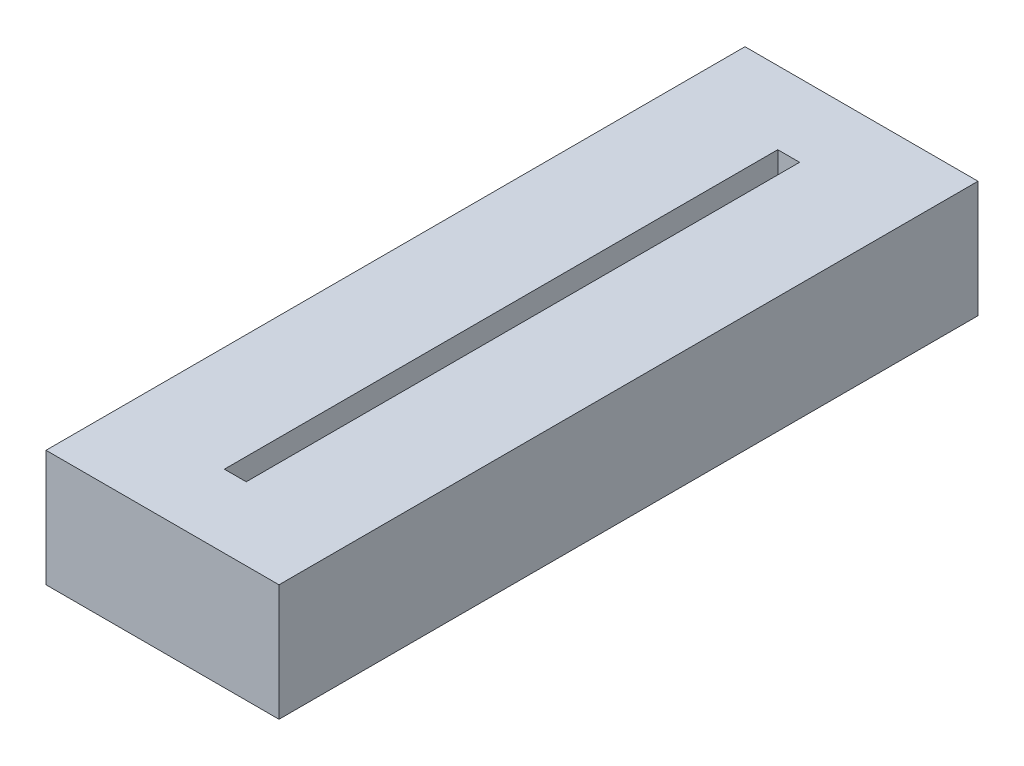
ISO-10303-21;
HEADER;
FILE_DESCRIPTION(('STEP AP214'),'2;1');
FILE_NAME('part.step','',(''),(''),'','','');
FILE_SCHEMA(('AUTOMOTIVE_DESIGN { 1 0 10303 214 1 1 1 1 }'));
ENDSEC;
DATA;
#1=APPLICATION_CONTEXT('core data for automotive mechanical design processes');
#2=APPLICATION_PROTOCOL_DEFINITION('international standard','automotive_design',2000,#1);
#3=PRODUCT_CONTEXT('',#1,'mechanical');
#4=PRODUCT('Part','Part','',(#3));
#5=PRODUCT_RELATED_PRODUCT_CATEGORY('part','',(#4));
#6=PRODUCT_DEFINITION_FORMATION('','',#4);
#7=PRODUCT_DEFINITION_CONTEXT('part definition',#1,'design');
#8=PRODUCT_DEFINITION('design','',#6,#7);
#9=PRODUCT_DEFINITION_SHAPE('','',#8);
#10=(LENGTH_UNIT() NAMED_UNIT(*) SI_UNIT(.MILLI.,.METRE.));
#11=(NAMED_UNIT(*) PLANE_ANGLE_UNIT() SI_UNIT($,.RADIAN.));
#12=(NAMED_UNIT(*) SI_UNIT($,.STERADIAN.) SOLID_ANGLE_UNIT());
#13=UNCERTAINTY_MEASURE_WITH_UNIT(LENGTH_MEASURE(1.E-05),#10,'distance_accuracy_value','');
#14=(GEOMETRIC_REPRESENTATION_CONTEXT(3) GLOBAL_UNCERTAINTY_ASSIGNED_CONTEXT((#13)) GLOBAL_UNIT_ASSIGNED_CONTEXT((#10,
#11,#12)) REPRESENTATION_CONTEXT('',''));
#15=CARTESIAN_POINT('',(0.,0.,0.));
#16=DIRECTION('',(0.,0.,1.));
#17=DIRECTION('',(1.,0.,0.));
#18=AXIS2_PLACEMENT_3D('',#15,#16,#17);
#19=CARTESIAN_POINT('',(0.,50.8,304.8));
#20=DIRECTION('',(1.,0.,0.));
#21=DIRECTION('',(0.,0.,-1.));
#22=AXIS2_PLACEMENT_3D('',#19,#20,#21);
#23=PLANE('',#22);
#24=DIRECTION('',(0.,-1.,0.));
#25=VECTOR('',#24,1.);
#26=CARTESIAN_POINT('',(0.,50.8,0.));
#27=LINE('',#26,#25);
#28=CARTESIAN_POINT('',(0.,50.8,0.));
#29=VERTEX_POINT('',#28);
#30=CARTESIAN_POINT('',(0.,0.,0.));
#31=VERTEX_POINT('',#30);
#32=EDGE_CURVE('E140',#29,#31,#27,.T.);
#33=ORIENTED_EDGE('',*,*,#32,.T.);
#34=DIRECTION('',(0.,0.,-1.));
#35=VECTOR('',#34,1.);
#36=CARTESIAN_POINT('',(0.,0.,304.8));
#37=LINE('',#36,#35);
#38=CARTESIAN_POINT('',(0.,0.,304.8));
#39=VERTEX_POINT('',#38);
#40=EDGE_CURVE('E11',#39,#31,#37,.T.);
#41=ORIENTED_EDGE('',*,*,#40,.F.);
#42=DIRECTION('',(0.,-1.,0.));
#43=VECTOR('',#42,1.);
#44=CARTESIAN_POINT('',(0.,50.8,304.8));
#45=LINE('',#44,#43);
#46=CARTESIAN_POINT('',(0.,50.8,304.8));
#47=VERTEX_POINT('',#46);
#48=EDGE_CURVE('E144',#47,#39,#45,.T.);
#49=ORIENTED_EDGE('',*,*,#48,.F.);
#50=DIRECTION('',(0.,0.,-1.));
#51=VECTOR('',#50,1.);
#52=CARTESIAN_POINT('',(0.,50.8,304.8));
#53=LINE('',#52,#51);
#54=EDGE_CURVE('E150',#47,#29,#53,.T.);
#55=ORIENTED_EDGE('',*,*,#54,.T.);
#56=EDGE_LOOP('',(#33,#41,#49,#55));
#57=FACE_BOUND('',#56,.T.);
#58=ADVANCED_FACE('F32',(#57),#23,.F.);
#59=CARTESIAN_POINT('',(0.,0.,304.8));
#60=DIRECTION('',(0.,1.,0.));
#61=DIRECTION('',(0.,0.,1.));
#62=AXIS2_PLACEMENT_3D('',#59,#60,#61);
#63=PLANE('',#62);
#64=DIRECTION('',(1.,0.,0.));
#65=VECTOR('',#64,1.);
#66=CARTESIAN_POINT('',(0.,0.,0.));
#67=LINE('',#66,#65);
#68=CARTESIAN_POINT('',(101.6,0.,0.));
#69=VERTEX_POINT('',#68);
#70=EDGE_CURVE('E153',#31,#69,#67,.T.);
#71=ORIENTED_EDGE('',*,*,#70,.T.);
#72=DIRECTION('',(0.,0.,-1.));
#73=VECTOR('',#72,1.);
#74=CARTESIAN_POINT('',(101.6,0.,304.8));
#75=LINE('',#74,#73);
#76=CARTESIAN_POINT('',(101.6,0.,304.8));
#77=VERTEX_POINT('',#76);
#78=EDGE_CURVE('E39',#77,#69,#75,.T.);
#79=ORIENTED_EDGE('',*,*,#78,.F.);
#80=DIRECTION('',(1.,0.,0.));
#81=VECTOR('',#80,1.);
#82=CARTESIAN_POINT('',(0.,0.,304.8));
#83=LINE('',#82,#81);
#84=EDGE_CURVE('E83',#39,#77,#83,.T.);
#85=ORIENTED_EDGE('',*,*,#84,.F.);
#86=ORIENTED_EDGE('',*,*,#40,.T.);
#87=EDGE_LOOP('',(#71,#79,#85,#86));
#88=FACE_BOUND('',#87,.T.);
#89=ADVANCED_FACE('F184',(#88),#63,.F.);
#90=CARTESIAN_POINT('',(101.6,0.,304.8));
#91=DIRECTION('',(-1.,0.,0.));
#92=DIRECTION('',(0.,0.,1.));
#93=AXIS2_PLACEMENT_3D('',#90,#91,#92);
#94=PLANE('',#93);
#95=DIRECTION('',(0.,1.,0.));
#96=VECTOR('',#95,1.);
#97=CARTESIAN_POINT('',(101.6,0.,0.));
#98=LINE('',#97,#96);
#99=CARTESIAN_POINT('',(101.6,50.8,0.));
#100=VERTEX_POINT('',#99);
#101=EDGE_CURVE('E155',#69,#100,#98,.T.);
#102=ORIENTED_EDGE('',*,*,#101,.T.);
#103=DIRECTION('',(0.,0.,-1.));
#104=VECTOR('',#103,1.);
#105=CARTESIAN_POINT('',(101.6,50.8,304.8));
#106=LINE('',#105,#104);
#107=CARTESIAN_POINT('',(101.6,50.8,304.8));
#108=VERTEX_POINT('',#107);
#109=EDGE_CURVE('E159',#108,#100,#106,.T.);
#110=ORIENTED_EDGE('',*,*,#109,.F.);
#111=DIRECTION('',(0.,1.,0.));
#112=VECTOR('',#111,1.);
#113=CARTESIAN_POINT('',(101.6,0.,304.8));
#114=LINE('',#113,#112);
#115=EDGE_CURVE('E147',#77,#108,#114,.T.);
#116=ORIENTED_EDGE('',*,*,#115,.F.);
#117=ORIENTED_EDGE('',*,*,#78,.T.);
#118=EDGE_LOOP('',(#102,#110,#116,#117));
#119=FACE_BOUND('',#118,.T.);
#120=ADVANCED_FACE('F164',(#119),#94,.F.);
#121=CARTESIAN_POINT('',(101.6,50.8,304.8));
#122=DIRECTION('',(0.,-1.,0.));
#123=DIRECTION('',(1.,0.,0.));
#124=AXIS2_PLACEMENT_3D('',#121,#122,#123);
#125=PLANE('',#124);
#126=DIRECTION('',(0.,0.,-1.));
#127=VECTOR('',#126,1.);
#128=CARTESIAN_POINT('',(55.5625,50.8,31.75));
#129=LINE('',#128,#127);
#130=CARTESIAN_POINT('',(55.5625,50.8,273.05));
#131=VERTEX_POINT('',#130);
#132=CARTESIAN_POINT('',(55.5625,50.8,31.75));
#133=VERTEX_POINT('',#132);
#134=EDGE_CURVE('E134',#131,#133,#129,.T.);
#135=ORIENTED_EDGE('',*,*,#134,.F.);
#136=DIRECTION('',(1.,0.,0.));
#137=VECTOR('',#136,1.);
#138=CARTESIAN_POINT('',(46.0375,50.8,273.05));
#139=LINE('',#138,#137);
#140=CARTESIAN_POINT('',(46.0375,50.8,273.05));
#141=VERTEX_POINT('',#140);
#142=EDGE_CURVE('E46',#141,#131,#139,.T.);
#143=ORIENTED_EDGE('',*,*,#142,.F.);
#144=DIRECTION('',(0.,0.,1.));
#145=VECTOR('',#144,1.);
#146=CARTESIAN_POINT('',(46.0375,50.8,263.525));
#147=LINE('',#146,#145);
#148=CARTESIAN_POINT('',(46.0375,50.8,31.75));
#149=VERTEX_POINT('',#148);
#150=EDGE_CURVE('E125',#149,#141,#147,.T.);
#151=ORIENTED_EDGE('',*,*,#150,.F.);
#152=DIRECTION('',(-1.,0.,0.));
#153=VECTOR('',#152,1.);
#154=CARTESIAN_POINT('',(46.0375,50.8,31.75));
#155=LINE('',#154,#153);
#156=EDGE_CURVE('E128',#133,#149,#155,.T.);
#157=ORIENTED_EDGE('',*,*,#156,.F.);
#158=EDGE_LOOP('',(#135,#143,#151,#157));
#159=FACE_BOUND('',#158,.T.);
#160=DIRECTION('',(-1.,0.,0.));
#161=VECTOR('',#160,1.);
#162=CARTESIAN_POINT('',(101.6,50.8,0.));
#163=LINE('',#162,#161);
#164=EDGE_CURVE('E76',#100,#29,#163,.T.);
#165=ORIENTED_EDGE('',*,*,#164,.T.);
#166=ORIENTED_EDGE('',*,*,#54,.F.);
#167=DIRECTION('',(-1.,0.,0.));
#168=VECTOR('',#167,1.);
#169=CARTESIAN_POINT('',(101.6,50.8,304.8));
#170=LINE('',#169,#168);
#171=EDGE_CURVE('E55',#108,#47,#170,.T.);
#172=ORIENTED_EDGE('',*,*,#171,.F.);
#173=ORIENTED_EDGE('',*,*,#109,.T.);
#174=EDGE_LOOP('',(#165,#166,#172,#173));
#175=FACE_BOUND('',#174,.T.);
#176=ADVANCED_FACE('F172',(#159,#175),#125,.F.);
#177=CARTESIAN_POINT('',(0.,0.,304.8));
#178=DIRECTION('',(0.,0.,1.));
#179=DIRECTION('',(1.,0.,0.));
#180=AXIS2_PLACEMENT_3D('',#177,#178,#179);
#181=PLANE('',#180);
#182=ORIENTED_EDGE('',*,*,#48,.T.);
#183=ORIENTED_EDGE('',*,*,#84,.T.);
#184=ORIENTED_EDGE('',*,*,#115,.T.);
#185=ORIENTED_EDGE('',*,*,#171,.T.);
#186=EDGE_LOOP('',(#182,#183,#184,#185));
#187=FACE_BOUND('',#186,.T.);
#188=ADVANCED_FACE('F174',(#187),#181,.T.);
#189=CARTESIAN_POINT('',(0.,0.,0.));
#190=DIRECTION('',(0.,0.,1.));
#191=DIRECTION('',(1.,0.,0.));
#192=AXIS2_PLACEMENT_3D('',#189,#190,#191);
#193=PLANE('',#192);
#194=ORIENTED_EDGE('',*,*,#32,.F.);
#195=ORIENTED_EDGE('',*,*,#164,.F.);
#196=ORIENTED_EDGE('',*,*,#101,.F.);
#197=ORIENTED_EDGE('',*,*,#70,.F.);
#198=EDGE_LOOP('',(#194,#195,#196,#197));
#199=FACE_BOUND('',#198,.T.);
#200=ADVANCED_FACE('F168',(#199),#193,.F.);
#201=CARTESIAN_POINT('',(46.0375,31.75,273.05));
#202=DIRECTION('',(0.,0.,1.));
#203=DIRECTION('',(1.,0.,0.));
#204=AXIS2_PLACEMENT_3D('',#201,#202,#203);
#205=PLANE('',#204);
#206=ORIENTED_EDGE('',*,*,#142,.T.);
#207=DIRECTION('',(0.,1.,0.));
#208=VECTOR('',#207,1.);
#209=CARTESIAN_POINT('',(55.5625,31.75,273.05));
#210=LINE('',#209,#208);
#211=CARTESIAN_POINT('',(55.5625,31.75,273.05));
#212=VERTEX_POINT('',#211);
#213=EDGE_CURVE('E103',#212,#131,#210,.T.);
#214=ORIENTED_EDGE('',*,*,#213,.F.);
#215=DIRECTION('',(1.,0.,0.));
#216=VECTOR('',#215,1.);
#217=CARTESIAN_POINT('',(46.0375,31.75,273.05));
#218=LINE('',#217,#216);
#219=CARTESIAN_POINT('',(46.0375,31.75,273.05));
#220=VERTEX_POINT('',#219);
#221=EDGE_CURVE('E107',#220,#212,#218,.T.);
#222=ORIENTED_EDGE('',*,*,#221,.F.);
#223=DIRECTION('',(0.,1.,0.));
#224=VECTOR('',#223,1.);
#225=CARTESIAN_POINT('',(46.0375,31.75,273.05));
#226=LINE('',#225,#224);
#227=EDGE_CURVE('E138',#220,#141,#226,.T.);
#228=ORIENTED_EDGE('',*,*,#227,.T.);
#229=EDGE_LOOP('',(#206,#214,#222,#228));
#230=FACE_BOUND('',#229,.T.);
#231=ADVANCED_FACE('F105',(#230),#205,.F.);
#232=CARTESIAN_POINT('',(46.0375,31.75,263.525));
#233=DIRECTION('',(-1.,0.,0.));
#234=DIRECTION('',(0.,-1.,0.));
#235=AXIS2_PLACEMENT_3D('',#232,#233,#234);
#236=PLANE('',#235);
#237=ORIENTED_EDGE('',*,*,#150,.T.);
#238=ORIENTED_EDGE('',*,*,#227,.F.);
#239=DIRECTION('',(0.,0.,1.));
#240=VECTOR('',#239,1.);
#241=CARTESIAN_POINT('',(46.0375,31.75,41.275));
#242=LINE('',#241,#240);
#243=CARTESIAN_POINT('',(46.0375,31.75,31.75));
#244=VERTEX_POINT('',#243);
#245=EDGE_CURVE('E112',#244,#220,#242,.T.);
#246=ORIENTED_EDGE('',*,*,#245,.F.);
#247=DIRECTION('',(0.,1.,0.));
#248=VECTOR('',#247,1.);
#249=CARTESIAN_POINT('',(46.0375,31.75,31.75));
#250=LINE('',#249,#248);
#251=EDGE_CURVE('E141',#244,#149,#250,.T.);
#252=ORIENTED_EDGE('',*,*,#251,.T.);
#253=EDGE_LOOP('',(#237,#238,#246,#252));
#254=FACE_BOUND('',#253,.T.);
#255=ADVANCED_FACE('F214',(#254),#236,.F.);
#256=CARTESIAN_POINT('',(46.0375,31.75,31.75));
#257=DIRECTION('',(0.,0.,-1.));
#258=DIRECTION('',(-1.,0.,0.));
#259=AXIS2_PLACEMENT_3D('',#256,#257,#258);
#260=PLANE('',#259);
#261=ORIENTED_EDGE('',*,*,#156,.T.);
#262=ORIENTED_EDGE('',*,*,#251,.F.);
#263=DIRECTION('',(-1.,0.,0.));
#264=VECTOR('',#263,1.);
#265=CARTESIAN_POINT('',(46.0375,31.75,31.75));
#266=LINE('',#265,#264);
#267=CARTESIAN_POINT('',(55.5625,31.75,31.75));
#268=VERTEX_POINT('',#267);
#269=EDGE_CURVE('E120',#268,#244,#266,.T.);
#270=ORIENTED_EDGE('',*,*,#269,.F.);
#271=DIRECTION('',(0.,1.,0.));
#272=VECTOR('',#271,1.);
#273=CARTESIAN_POINT('',(55.5625,31.75,31.75));
#274=LINE('',#273,#272);
#275=EDGE_CURVE('E111',#268,#133,#274,.T.);
#276=ORIENTED_EDGE('',*,*,#275,.T.);
#277=EDGE_LOOP('',(#261,#262,#270,#276));
#278=FACE_BOUND('',#277,.T.);
#279=ADVANCED_FACE('F221',(#278),#260,.F.);
#280=CARTESIAN_POINT('',(55.5625,31.75,31.75));
#281=DIRECTION('',(1.,0.,0.));
#282=DIRECTION('',(0.,1.,0.));
#283=AXIS2_PLACEMENT_3D('',#280,#281,#282);
#284=PLANE('',#283);
#285=ORIENTED_EDGE('',*,*,#134,.T.);
#286=ORIENTED_EDGE('',*,*,#275,.F.);
#287=DIRECTION('',(0.,0.,-1.));
#288=VECTOR('',#287,1.);
#289=CARTESIAN_POINT('',(55.5625,31.75,273.05));
#290=LINE('',#289,#288);
#291=EDGE_CURVE('E115',#212,#268,#290,.T.);
#292=ORIENTED_EDGE('',*,*,#291,.F.);
#293=ORIENTED_EDGE('',*,*,#213,.T.);
#294=EDGE_LOOP('',(#285,#286,#292,#293));
#295=FACE_BOUND('',#294,.T.);
#296=ADVANCED_FACE('F116',(#295),#284,.F.);
#297=CARTESIAN_POINT('',(0.,31.75,0.));
#298=DIRECTION('',(0.,1.,0.));
#299=DIRECTION('',(0.,0.,1.));
#300=AXIS2_PLACEMENT_3D('',#297,#298,#299);
#301=PLANE('',#300);
#302=ORIENTED_EDGE('',*,*,#221,.T.);
#303=ORIENTED_EDGE('',*,*,#291,.T.);
#304=ORIENTED_EDGE('',*,*,#269,.T.);
#305=ORIENTED_EDGE('',*,*,#245,.T.);
#306=EDGE_LOOP('',(#302,#303,#304,#305));
#307=FACE_BOUND('',#306,.T.);
#308=ADVANCED_FACE('F122',(#307),#301,.T.);
#309=CLOSED_SHELL('',(#58,#89,#120,#176,#188,#200,#231,#255,#279,#296,#308));
#310=MANIFOLD_SOLID_BREP('B2',#309);
#311=ADVANCED_BREP_SHAPE_REPRESENTATION('',(#18,#310),#14);
#312=SHAPE_DEFINITION_REPRESENTATION(#9,#311);
ENDSEC;
END-ISO-10303-21;
